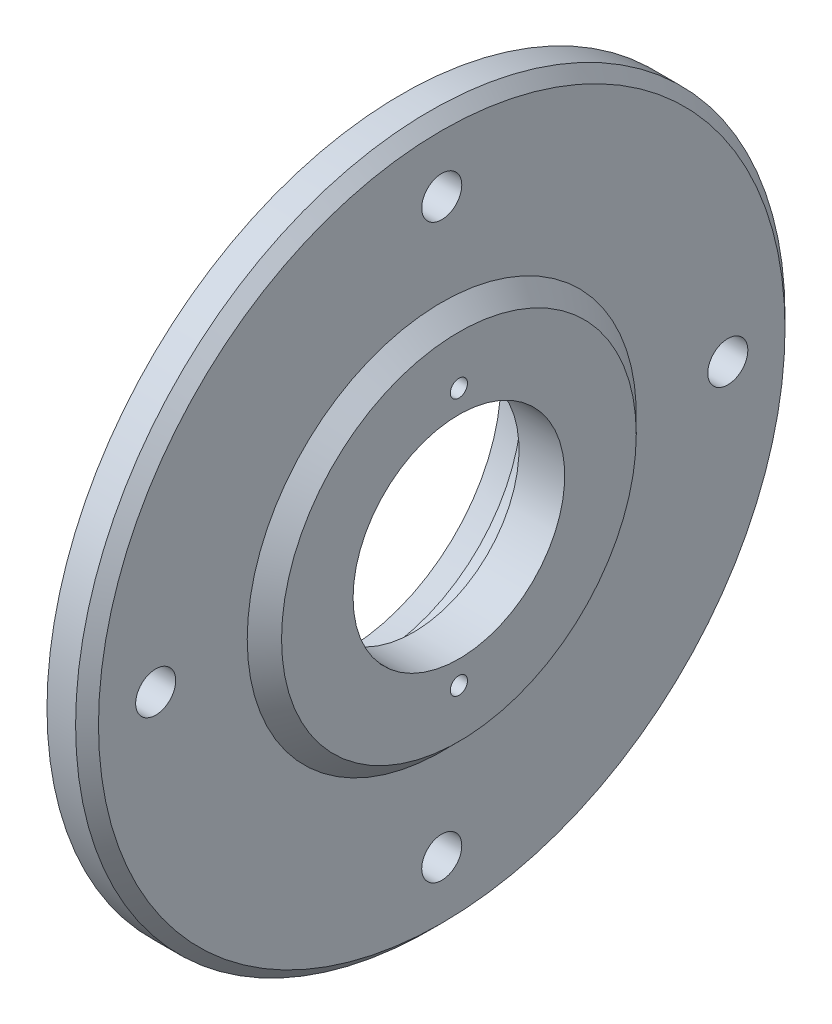
ISO-10303-21;
HEADER;
FILE_DESCRIPTION(('STEP AP214'),'2;1');
FILE_NAME('part.step','',(''),(''),'','','');
FILE_SCHEMA(('AUTOMOTIVE_DESIGN { 1 0 10303 214 1 1 1 1 }'));
ENDSEC;
DATA;
#1=APPLICATION_CONTEXT('core data for automotive mechanical design processes');
#2=APPLICATION_PROTOCOL_DEFINITION('international standard','automotive_design',2000,#1);
#3=PRODUCT_CONTEXT('',#1,'mechanical');
#4=PRODUCT('Part','Part','',(#3));
#5=PRODUCT_RELATED_PRODUCT_CATEGORY('part','',(#4));
#6=PRODUCT_DEFINITION_FORMATION('','',#4);
#7=PRODUCT_DEFINITION_CONTEXT('part definition',#1,'design');
#8=PRODUCT_DEFINITION('design','',#6,#7);
#9=PRODUCT_DEFINITION_SHAPE('','',#8);
#10=(LENGTH_UNIT() NAMED_UNIT(*) SI_UNIT(.MILLI.,.METRE.));
#11=(NAMED_UNIT(*) PLANE_ANGLE_UNIT() SI_UNIT($,.RADIAN.));
#12=(NAMED_UNIT(*) SI_UNIT($,.STERADIAN.) SOLID_ANGLE_UNIT());
#13=UNCERTAINTY_MEASURE_WITH_UNIT(LENGTH_MEASURE(1.E-05),#10,'distance_accuracy_value','');
#14=(GEOMETRIC_REPRESENTATION_CONTEXT(3) GLOBAL_UNCERTAINTY_ASSIGNED_CONTEXT((#13)) GLOBAL_UNIT_ASSIGNED_CONTEXT((#10,
#11,#12)) REPRESENTATION_CONTEXT('',''));
#15=CARTESIAN_POINT('',(0.,0.,0.));
#16=DIRECTION('',(0.,0.,1.));
#17=DIRECTION('',(1.,0.,0.));
#18=AXIS2_PLACEMENT_3D('',#15,#16,#17);
#19=CARTESIAN_POINT('',(-20.7774798927614,0.,0.));
#20=DIRECTION('',(-1.,0.,0.));
#21=DIRECTION('',(0.,0.,1.));
#22=AXIS2_PLACEMENT_3D('',#19,#20,#21);
#23=CYLINDRICAL_SURFACE('',#22,62.);
#24=CARTESIAN_POINT('',(3.,0.,0.));
#25=DIRECTION('',(-1.,0.,0.));
#26=DIRECTION('',(0.,0.,1.));
#27=AXIS2_PLACEMENT_3D('',#24,#25,#26);
#28=CIRCLE('',#27,62.);
#29=CARTESIAN_POINT('',(3.,0.,62.));
#30=VERTEX_POINT('',#29);
#31=EDGE_CURVE('E40',#30,#30,#28,.T.);
#32=ORIENTED_EDGE('',*,*,#31,.T.);
#33=EDGE_LOOP('',(#32));
#34=FACE_BOUND('',#33,.T.);
#35=CARTESIAN_POINT('',(-2.,0.,0.));
#36=DIRECTION('',(-1.,0.,0.));
#37=DIRECTION('',(0.,0.,1.));
#38=AXIS2_PLACEMENT_3D('',#35,#36,#37);
#39=CIRCLE('',#38,62.);
#40=CARTESIAN_POINT('',(-2.,0.,62.));
#41=VERTEX_POINT('',#40);
#42=EDGE_CURVE('E74',#41,#41,#39,.T.);
#43=ORIENTED_EDGE('',*,*,#42,.F.);
#44=EDGE_LOOP('',(#43));
#45=FACE_BOUND('',#44,.T.);
#46=ADVANCED_FACE('F33',(#34,#45),#23,.T.);
#47=CARTESIAN_POINT('',(5.,62.,0.));
#48=DIRECTION('',(-1.,0.,0.));
#49=DIRECTION('',(0.,0.,1.));
#50=AXIS2_PLACEMENT_3D('',#47,#48,#49);
#51=PLANE('',#50);
#52=CARTESIAN_POINT('',(5.,-1.74574066942157E-13,-50.));
#53=DIRECTION('',(1.,0.,0.));
#54=DIRECTION('',(0.,-1.,0.));
#55=AXIS2_PLACEMENT_3D('',#52,#53,#54);
#56=CIRCLE('',#55,3.5);
#57=CARTESIAN_POINT('',(5.,-3.50000000000018,-50.));
#58=VERTEX_POINT('',#57);
#59=EDGE_CURVE('E106',#58,#58,#56,.T.);
#60=ORIENTED_EDGE('',*,*,#59,.F.);
#61=EDGE_LOOP('',(#60));
#62=FACE_BOUND('',#61,.T.);
#63=CARTESIAN_POINT('',(5.,-50.,0.));
#64=DIRECTION('',(1.,0.,0.));
#65=DIRECTION('',(0.,0.,1.));
#66=AXIS2_PLACEMENT_3D('',#63,#64,#65);
#67=CIRCLE('',#66,3.5);
#68=CARTESIAN_POINT('',(5.,-50.,3.5));
#69=VERTEX_POINT('',#68);
#70=EDGE_CURVE('E99',#69,#69,#67,.T.);
#71=ORIENTED_EDGE('',*,*,#70,.F.);
#72=EDGE_LOOP('',(#71));
#73=FACE_BOUND('',#72,.T.);
#74=CARTESIAN_POINT('',(5.,5.2372220082647E-13,50.));
#75=DIRECTION('',(1.,0.,0.));
#76=DIRECTION('',(0.,1.,0.));
#77=AXIS2_PLACEMENT_3D('',#74,#75,#76);
#78=CIRCLE('',#77,3.5);
#79=CARTESIAN_POINT('',(5.,3.50000000000052,50.));
#80=VERTEX_POINT('',#79);
#81=EDGE_CURVE('E100',#80,#80,#78,.T.);
#82=ORIENTED_EDGE('',*,*,#81,.F.);
#83=EDGE_LOOP('',(#82));
#84=FACE_BOUND('',#83,.T.);
#85=CARTESIAN_POINT('',(5.,50.,0.));
#86=DIRECTION('',(1.,0.,0.));
#87=DIRECTION('',(0.,0.,-1.));
#88=AXIS2_PLACEMENT_3D('',#85,#86,#87);
#89=CIRCLE('',#88,3.5);
#90=CARTESIAN_POINT('',(5.,50.,-3.5));
#91=VERTEX_POINT('',#90);
#92=EDGE_CURVE('E92',#91,#91,#89,.T.);
#93=ORIENTED_EDGE('',*,*,#92,.F.);
#94=EDGE_LOOP('',(#93));
#95=FACE_BOUND('',#94,.T.);
#96=CARTESIAN_POINT('',(5.,0.,0.));
#97=DIRECTION('',(-1.,0.,0.));
#98=DIRECTION('',(0.,0.,1.));
#99=AXIS2_PLACEMENT_3D('',#96,#97,#98);
#100=CIRCLE('',#99,60.);
#101=CARTESIAN_POINT('',(5.,0.,60.));
#102=VERTEX_POINT('',#101);
#103=EDGE_CURVE('E10',#102,#102,#100,.F.);
#104=ORIENTED_EDGE('',*,*,#103,.T.);
#105=EDGE_LOOP('',(#104));
#106=FACE_BOUND('',#105,.T.);
#107=CARTESIAN_POINT('',(5.,0.,0.));
#108=DIRECTION('',(-1.,0.,0.));
#109=DIRECTION('',(0.,0.,1.));
#110=AXIS2_PLACEMENT_3D('',#107,#108,#109);
#111=CIRCLE('',#110,34.);
#112=CARTESIAN_POINT('',(5.,0.,34.));
#113=VERTEX_POINT('',#112);
#114=EDGE_CURVE('E44',#113,#113,#111,.T.);
#115=ORIENTED_EDGE('',*,*,#114,.T.);
#116=EDGE_LOOP('',(#115));
#117=FACE_BOUND('',#116,.T.);
#118=ADVANCED_FACE('F117',(#62,#73,#84,#95,#106,#117),#51,.F.);
#119=CARTESIAN_POINT('',(8.,0.,0.));
#120=DIRECTION('',(-1.,0.,0.));
#121=DIRECTION('',(0.,0.,1.));
#122=AXIS2_PLACEMENT_3D('',#119,#120,#121);
#123=CONICAL_SURFACE('',#122,31.,0.785398163397454);
#124=ORIENTED_EDGE('',*,*,#114,.F.);
#125=EDGE_LOOP('',(#124));
#126=FACE_BOUND('',#125,.T.);
#127=CARTESIAN_POINT('',(8.,0.,0.));
#128=DIRECTION('',(-1.,0.,0.));
#129=DIRECTION('',(0.,0.,1.));
#130=AXIS2_PLACEMENT_3D('',#127,#128,#129);
#131=CIRCLE('',#130,31.);
#132=CARTESIAN_POINT('',(8.,0.,31.));
#133=VERTEX_POINT('',#132);
#134=EDGE_CURVE('E48',#133,#133,#131,.T.);
#135=ORIENTED_EDGE('',*,*,#134,.T.);
#136=EDGE_LOOP('',(#135));
#137=FACE_BOUND('',#136,.T.);
#138=ADVANCED_FACE('F120',(#126,#137),#123,.T.);
#139=CARTESIAN_POINT('',(8.,31.,0.));
#140=DIRECTION('',(-1.,0.,0.));
#141=DIRECTION('',(0.,0.,1.));
#142=AXIS2_PLACEMENT_3D('',#139,#140,#141);
#143=PLANE('',#142);
#144=CARTESIAN_POINT('',(8.,-22.5,0.));
#145=DIRECTION('',(1.,0.,0.));
#146=DIRECTION('',(0.,0.,1.));
#147=AXIS2_PLACEMENT_3D('',#144,#145,#146);
#148=CIRCLE('',#147,1.5);
#149=CARTESIAN_POINT('',(8.,-22.5,1.5));
#150=VERTEX_POINT('',#149);
#151=EDGE_CURVE('E86',#150,#150,#148,.T.);
#152=ORIENTED_EDGE('',*,*,#151,.F.);
#153=EDGE_LOOP('',(#152));
#154=FACE_BOUND('',#153,.T.);
#155=CARTESIAN_POINT('',(8.,22.5,0.));
#156=DIRECTION('',(1.,0.,0.));
#157=DIRECTION('',(0.,0.,-1.));
#158=AXIS2_PLACEMENT_3D('',#155,#156,#157);
#159=CIRCLE('',#158,1.5);
#160=CARTESIAN_POINT('',(8.,22.5,-1.5));
#161=VERTEX_POINT('',#160);
#162=EDGE_CURVE('E80',#161,#161,#159,.T.);
#163=ORIENTED_EDGE('',*,*,#162,.F.);
#164=EDGE_LOOP('',(#163));
#165=FACE_BOUND('',#164,.T.);
#166=ORIENTED_EDGE('',*,*,#134,.F.);
#167=EDGE_LOOP('',(#166));
#168=FACE_BOUND('',#167,.T.);
#169=CARTESIAN_POINT('',(8.,0.,0.));
#170=DIRECTION('',(-1.,0.,0.));
#171=DIRECTION('',(0.,0.,1.));
#172=AXIS2_PLACEMENT_3D('',#169,#170,#171);
#173=CIRCLE('',#172,18.5);
#174=CARTESIAN_POINT('',(8.,0.,18.5));
#175=VERTEX_POINT('',#174);
#176=EDGE_CURVE('E53',#175,#175,#173,.T.);
#177=ORIENTED_EDGE('',*,*,#176,.T.);
#178=EDGE_LOOP('',(#177));
#179=FACE_BOUND('',#178,.T.);
#180=ADVANCED_FACE('F132',(#154,#165,#168,#179),#143,.F.);
#181=CARTESIAN_POINT('',(-20.7774798927614,0.,0.));
#182=DIRECTION('',(-1.,0.,0.));
#183=DIRECTION('',(0.,0.,1.));
#184=AXIS2_PLACEMENT_3D('',#181,#182,#183);
#185=CYLINDRICAL_SURFACE('',#184,18.5);
#186=ORIENTED_EDGE('',*,*,#176,.F.);
#187=EDGE_LOOP('',(#186));
#188=FACE_BOUND('',#187,.T.);
#189=CARTESIAN_POINT('',(0.,0.,0.));
#190=DIRECTION('',(-1.,0.,0.));
#191=DIRECTION('',(0.,0.,1.));
#192=AXIS2_PLACEMENT_3D('',#189,#190,#191);
#193=CIRCLE('',#192,18.5);
#194=CARTESIAN_POINT('',(0.,0.,18.5));
#195=VERTEX_POINT('',#194);
#196=EDGE_CURVE('E56',#195,#195,#193,.T.);
#197=ORIENTED_EDGE('',*,*,#196,.T.);
#198=EDGE_LOOP('',(#197));
#199=FACE_BOUND('',#198,.T.);
#200=ADVANCED_FACE('F138',(#188,#199),#185,.F.);
#201=CARTESIAN_POINT('',(0.,26.,0.));
#202=DIRECTION('',(1.,0.,0.));
#203=DIRECTION('',(0.,0.,-1.));
#204=AXIS2_PLACEMENT_3D('',#201,#202,#203);
#205=PLANE('',#204);
#206=CARTESIAN_POINT('',(0.,-22.5,0.));
#207=DIRECTION('',(1.,0.,0.));
#208=DIRECTION('',(0.,0.,-1.));
#209=AXIS2_PLACEMENT_3D('',#206,#207,#208);
#210=CIRCLE('',#209,1.5);
#211=CARTESIAN_POINT('',(0.,-22.5,-1.5));
#212=VERTEX_POINT('',#211);
#213=EDGE_CURVE('E83',#212,#212,#210,.F.);
#214=ORIENTED_EDGE('',*,*,#213,.F.);
#215=EDGE_LOOP('',(#214));
#216=FACE_BOUND('',#215,.T.);
#217=CARTESIAN_POINT('',(0.,22.5,0.));
#218=DIRECTION('',(1.,0.,0.));
#219=DIRECTION('',(0.,0.,-1.));
#220=AXIS2_PLACEMENT_3D('',#217,#218,#219);
#221=CIRCLE('',#220,1.5);
#222=CARTESIAN_POINT('',(0.,22.5,-1.5));
#223=VERTEX_POINT('',#222);
#224=EDGE_CURVE('E77',#223,#223,#221,.F.);
#225=ORIENTED_EDGE('',*,*,#224,.F.);
#226=EDGE_LOOP('',(#225));
#227=FACE_BOUND('',#226,.T.);
#228=ORIENTED_EDGE('',*,*,#196,.F.);
#229=EDGE_LOOP('',(#228));
#230=FACE_BOUND('',#229,.T.);
#231=CARTESIAN_POINT('',(0.,0.,0.));
#232=DIRECTION('',(-1.,0.,0.));
#233=DIRECTION('',(0.,0.,1.));
#234=AXIS2_PLACEMENT_3D('',#231,#232,#233);
#235=CIRCLE('',#234,26.);
#236=CARTESIAN_POINT('',(0.,0.,26.));
#237=VERTEX_POINT('',#236);
#238=EDGE_CURVE('E59',#237,#237,#235,.T.);
#239=ORIENTED_EDGE('',*,*,#238,.T.);
#240=EDGE_LOOP('',(#239));
#241=FACE_BOUND('',#240,.T.);
#242=ADVANCED_FACE('F145',(#216,#227,#230,#241),#205,.F.);
#243=CARTESIAN_POINT('',(-20.7774798927614,0.,0.));
#244=DIRECTION('',(-1.,0.,0.));
#245=DIRECTION('',(0.,0.,1.));
#246=AXIS2_PLACEMENT_3D('',#243,#244,#245);
#247=CYLINDRICAL_SURFACE('',#246,26.);
#248=ORIENTED_EDGE('',*,*,#238,.F.);
#249=EDGE_LOOP('',(#248));
#250=FACE_BOUND('',#249,.T.);
#251=CARTESIAN_POINT('',(-7.,0.,0.));
#252=DIRECTION('',(-1.,0.,0.));
#253=DIRECTION('',(0.,0.,1.));
#254=AXIS2_PLACEMENT_3D('',#251,#252,#253);
#255=CIRCLE('',#254,26.);
#256=CARTESIAN_POINT('',(-7.,0.,26.));
#257=VERTEX_POINT('',#256);
#258=EDGE_CURVE('E62',#257,#257,#255,.T.);
#259=ORIENTED_EDGE('',*,*,#258,.T.);
#260=EDGE_LOOP('',(#259));
#261=FACE_BOUND('',#260,.T.);
#262=ADVANCED_FACE('F151',(#250,#261),#247,.F.);
#263=CARTESIAN_POINT('',(-12.,0.,0.));
#264=DIRECTION('',(-1.,0.,0.));
#265=DIRECTION('',(0.,0.,1.));
#266=AXIS2_PLACEMENT_3D('',#263,#264,#265);
#267=CONICAL_SURFACE('',#266,27.3397459621556,0.261799387799149);
#268=ORIENTED_EDGE('',*,*,#258,.F.);
#269=EDGE_LOOP('',(#268));
#270=FACE_BOUND('',#269,.T.);
#271=CARTESIAN_POINT('',(-12.,0.,0.));
#272=DIRECTION('',(-1.,0.,0.));
#273=DIRECTION('',(0.,0.,1.));
#274=AXIS2_PLACEMENT_3D('',#271,#272,#273);
#275=CIRCLE('',#274,27.3397459621556);
#276=CARTESIAN_POINT('',(-12.,0.,27.3397459621556));
#277=VERTEX_POINT('',#276);
#278=EDGE_CURVE('E65',#277,#277,#275,.T.);
#279=ORIENTED_EDGE('',*,*,#278,.T.);
#280=EDGE_LOOP('',(#279));
#281=FACE_BOUND('',#280,.T.);
#282=ADVANCED_FACE('F158',(#270,#281),#267,.F.);
#283=CARTESIAN_POINT('',(-12.,34.,0.));
#284=DIRECTION('',(1.,0.,0.));
#285=DIRECTION('',(0.,0.,-1.));
#286=AXIS2_PLACEMENT_3D('',#283,#284,#285);
#287=PLANE('',#286);
#288=ORIENTED_EDGE('',*,*,#278,.F.);
#289=EDGE_LOOP('',(#288));
#290=FACE_BOUND('',#289,.T.);
#291=CARTESIAN_POINT('',(-12.,0.,0.));
#292=DIRECTION('',(-1.,0.,0.));
#293=DIRECTION('',(0.,0.,1.));
#294=AXIS2_PLACEMENT_3D('',#291,#292,#293);
#295=CIRCLE('',#294,34.);
#296=CARTESIAN_POINT('',(-12.,0.,34.));
#297=VERTEX_POINT('',#296);
#298=EDGE_CURVE('E68',#297,#297,#295,.T.);
#299=ORIENTED_EDGE('',*,*,#298,.T.);
#300=EDGE_LOOP('',(#299));
#301=FACE_BOUND('',#300,.T.);
#302=ADVANCED_FACE('F164',(#290,#301),#287,.F.);
#303=CARTESIAN_POINT('',(-20.7774798927614,0.,0.));
#304=DIRECTION('',(-1.,0.,0.));
#305=DIRECTION('',(0.,0.,1.));
#306=AXIS2_PLACEMENT_3D('',#303,#304,#305);
#307=CYLINDRICAL_SURFACE('',#306,34.);
#308=ORIENTED_EDGE('',*,*,#298,.F.);
#309=EDGE_LOOP('',(#308));
#310=FACE_BOUND('',#309,.T.);
#311=CARTESIAN_POINT('',(-2.,0.,0.));
#312=DIRECTION('',(-1.,0.,0.));
#313=DIRECTION('',(0.,0.,1.));
#314=AXIS2_PLACEMENT_3D('',#311,#312,#313);
#315=CIRCLE('',#314,34.);
#316=CARTESIAN_POINT('',(-2.,0.,34.));
#317=VERTEX_POINT('',#316);
#318=EDGE_CURVE('E71',#317,#317,#315,.T.);
#319=ORIENTED_EDGE('',*,*,#318,.T.);
#320=EDGE_LOOP('',(#319));
#321=FACE_BOUND('',#320,.T.);
#322=ADVANCED_FACE('F170',(#310,#321),#307,.T.);
#323=CARTESIAN_POINT('',(-2.,62.,0.));
#324=DIRECTION('',(1.,0.,0.));
#325=DIRECTION('',(0.,0.,-1.));
#326=AXIS2_PLACEMENT_3D('',#323,#324,#325);
#327=PLANE('',#326);
#328=CARTESIAN_POINT('',(-2.,-1.74574066942157E-13,-50.));
#329=DIRECTION('',(1.,0.,0.));
#330=DIRECTION('',(0.,0.,-1.));
#331=AXIS2_PLACEMENT_3D('',#328,#329,#330);
#332=CIRCLE('',#331,3.5);
#333=CARTESIAN_POINT('',(-2.,-1.74574066942157E-13,-53.5));
#334=VERTEX_POINT('',#333);
#335=EDGE_CURVE('E95',#334,#334,#332,.F.);
#336=ORIENTED_EDGE('',*,*,#335,.F.);
#337=EDGE_LOOP('',(#336));
#338=FACE_BOUND('',#337,.T.);
#339=CARTESIAN_POINT('',(-2.,-50.,0.));
#340=DIRECTION('',(1.,0.,0.));
#341=DIRECTION('',(0.,0.,-1.));
#342=AXIS2_PLACEMENT_3D('',#339,#340,#341);
#343=CIRCLE('',#342,3.5);
#344=CARTESIAN_POINT('',(-2.,-50.,-3.5));
#345=VERTEX_POINT('',#344);
#346=EDGE_CURVE('E103',#345,#345,#343,.F.);
#347=ORIENTED_EDGE('',*,*,#346,.F.);
#348=EDGE_LOOP('',(#347));
#349=FACE_BOUND('',#348,.T.);
#350=CARTESIAN_POINT('',(-2.,5.2372220082647E-13,50.));
#351=DIRECTION('',(1.,0.,0.));
#352=DIRECTION('',(0.,0.,-1.));
#353=AXIS2_PLACEMENT_3D('',#350,#351,#352);
#354=CIRCLE('',#353,3.5);
#355=CARTESIAN_POINT('',(-2.,5.2372220082647E-13,46.5));
#356=VERTEX_POINT('',#355);
#357=EDGE_CURVE('E96',#356,#356,#354,.F.);
#358=ORIENTED_EDGE('',*,*,#357,.F.);
#359=EDGE_LOOP('',(#358));
#360=FACE_BOUND('',#359,.T.);
#361=CARTESIAN_POINT('',(-2.,50.,0.));
#362=DIRECTION('',(1.,0.,0.));
#363=DIRECTION('',(0.,0.,-1.));
#364=AXIS2_PLACEMENT_3D('',#361,#362,#363);
#365=CIRCLE('',#364,3.5);
#366=CARTESIAN_POINT('',(-2.,50.,-3.5));
#367=VERTEX_POINT('',#366);
#368=EDGE_CURVE('E89',#367,#367,#365,.F.);
#369=ORIENTED_EDGE('',*,*,#368,.F.);
#370=EDGE_LOOP('',(#369));
#371=FACE_BOUND('',#370,.T.);
#372=ORIENTED_EDGE('',*,*,#318,.F.);
#373=EDGE_LOOP('',(#372));
#374=FACE_BOUND('',#373,.T.);
#375=ORIENTED_EDGE('',*,*,#42,.T.);
#376=EDGE_LOOP('',(#375));
#377=FACE_BOUND('',#376,.T.);
#378=ADVANCED_FACE('F176',(#338,#349,#360,#371,#374,#377),#327,.F.);
#379=CARTESIAN_POINT('',(3.,0.,0.));
#380=DIRECTION('',(-1.,0.,0.));
#381=DIRECTION('',(0.,0.,1.));
#382=AXIS2_PLACEMENT_3D('',#379,#380,#381);
#383=CONICAL_SURFACE('',#382,62.,0.785398163397453);
#384=ORIENTED_EDGE('',*,*,#103,.F.);
#385=EDGE_LOOP('',(#384));
#386=FACE_BOUND('',#385,.T.);
#387=ORIENTED_EDGE('',*,*,#31,.F.);
#388=EDGE_LOOP('',(#387));
#389=FACE_BOUND('',#388,.T.);
#390=ADVANCED_FACE('F35',(#386,#389),#383,.T.);
#391=CARTESIAN_POINT('',(-12.001,22.5,0.));
#392=DIRECTION('',(1.,0.,0.));
#393=DIRECTION('',(0.,0.,-1.));
#394=AXIS2_PLACEMENT_3D('',#391,#392,#393);
#395=CYLINDRICAL_SURFACE('',#394,1.5);
#396=ORIENTED_EDGE('',*,*,#162,.T.);
#397=EDGE_LOOP('',(#396));
#398=FACE_BOUND('',#397,.T.);
#399=ORIENTED_EDGE('',*,*,#224,.T.);
#400=EDGE_LOOP('',(#399));
#401=FACE_BOUND('',#400,.T.);
#402=ADVANCED_FACE('F190',(#398,#401),#395,.F.);
#403=CARTESIAN_POINT('',(-12.001,-22.5,0.));
#404=DIRECTION('',(1.,0.,0.));
#405=DIRECTION('',(0.,0.,-1.));
#406=AXIS2_PLACEMENT_3D('',#403,#404,#405);
#407=CYLINDRICAL_SURFACE('',#406,1.5);
#408=ORIENTED_EDGE('',*,*,#151,.T.);
#409=EDGE_LOOP('',(#408));
#410=FACE_BOUND('',#409,.T.);
#411=ORIENTED_EDGE('',*,*,#213,.T.);
#412=EDGE_LOOP('',(#411));
#413=FACE_BOUND('',#412,.T.);
#414=ADVANCED_FACE('F193',(#410,#413),#407,.F.);
#415=CARTESIAN_POINT('',(-12.001,50.,0.));
#416=DIRECTION('',(1.,0.,0.));
#417=DIRECTION('',(0.,0.,-1.));
#418=AXIS2_PLACEMENT_3D('',#415,#416,#417);
#419=CYLINDRICAL_SURFACE('',#418,3.5);
#420=ORIENTED_EDGE('',*,*,#92,.T.);
#421=EDGE_LOOP('',(#420));
#422=FACE_BOUND('',#421,.T.);
#423=ORIENTED_EDGE('',*,*,#368,.T.);
#424=EDGE_LOOP('',(#423));
#425=FACE_BOUND('',#424,.T.);
#426=ADVANCED_FACE('F197',(#422,#425),#419,.F.);
#427=CARTESIAN_POINT('',(-12.001,5.2372220082647E-13,50.));
#428=DIRECTION('',(1.,0.,0.));
#429=DIRECTION('',(0.,0.,-1.));
#430=AXIS2_PLACEMENT_3D('',#427,#428,#429);
#431=CYLINDRICAL_SURFACE('',#430,3.5);
#432=ORIENTED_EDGE('',*,*,#81,.T.);
#433=EDGE_LOOP('',(#432));
#434=FACE_BOUND('',#433,.T.);
#435=ORIENTED_EDGE('',*,*,#357,.T.);
#436=EDGE_LOOP('',(#435));
#437=FACE_BOUND('',#436,.T.);
#438=ADVANCED_FACE('F201',(#434,#437),#431,.F.);
#439=CARTESIAN_POINT('',(-12.001,-50.,0.));
#440=DIRECTION('',(1.,0.,0.));
#441=DIRECTION('',(0.,0.,-1.));
#442=AXIS2_PLACEMENT_3D('',#439,#440,#441);
#443=CYLINDRICAL_SURFACE('',#442,3.5);
#444=ORIENTED_EDGE('',*,*,#70,.T.);
#445=EDGE_LOOP('',(#444));
#446=FACE_BOUND('',#445,.T.);
#447=ORIENTED_EDGE('',*,*,#346,.T.);
#448=EDGE_LOOP('',(#447));
#449=FACE_BOUND('',#448,.T.);
#450=ADVANCED_FACE('F205',(#446,#449),#443,.F.);
#451=CARTESIAN_POINT('',(-12.001,-1.74574066942157E-13,-50.));
#452=DIRECTION('',(1.,0.,0.));
#453=DIRECTION('',(0.,0.,-1.));
#454=AXIS2_PLACEMENT_3D('',#451,#452,#453);
#455=CYLINDRICAL_SURFACE('',#454,3.5);
#456=ORIENTED_EDGE('',*,*,#59,.T.);
#457=EDGE_LOOP('',(#456));
#458=FACE_BOUND('',#457,.T.);
#459=ORIENTED_EDGE('',*,*,#335,.T.);
#460=EDGE_LOOP('',(#459));
#461=FACE_BOUND('',#460,.T.);
#462=ADVANCED_FACE('F114',(#458,#461),#455,.F.);
#463=CLOSED_SHELL('',(#46,#118,#138,#180,#200,#242,#262,#282,#302,#322,#378,#390,#402,#414,#426,
#438,#450,#462));
#464=MANIFOLD_SOLID_BREP('B2',#463);
#465=ADVANCED_BREP_SHAPE_REPRESENTATION('',(#18,#464),#14);
#466=SHAPE_DEFINITION_REPRESENTATION(#9,#465);
ENDSEC;
END-ISO-10303-21;
